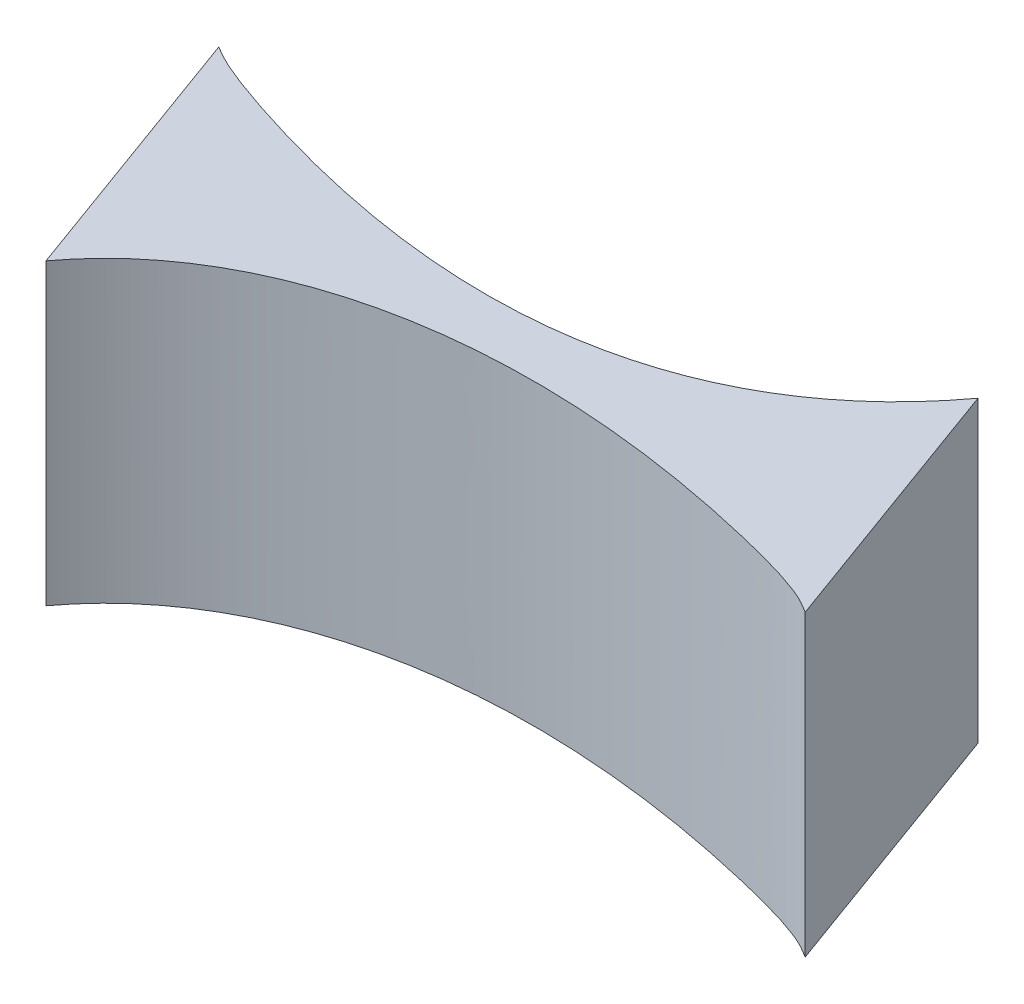
ISO-10303-21;
HEADER;
FILE_DESCRIPTION(('STEP AP214'),'2;1');
FILE_NAME('part.step','',(''),(''),'','','');
FILE_SCHEMA(('AUTOMOTIVE_DESIGN { 1 0 10303 214 1 1 1 1 }'));
ENDSEC;
DATA;
#1=APPLICATION_CONTEXT('core data for automotive mechanical design processes');
#2=APPLICATION_PROTOCOL_DEFINITION('international standard','automotive_design',2000,#1);
#3=PRODUCT_CONTEXT('',#1,'mechanical');
#4=PRODUCT('Part','Part','',(#3));
#5=PRODUCT_RELATED_PRODUCT_CATEGORY('part','',(#4));
#6=PRODUCT_DEFINITION_FORMATION('','',#4);
#7=PRODUCT_DEFINITION_CONTEXT('part definition',#1,'design');
#8=PRODUCT_DEFINITION('design','',#6,#7);
#9=PRODUCT_DEFINITION_SHAPE('','',#8);
#10=(LENGTH_UNIT() NAMED_UNIT(*) SI_UNIT(.MILLI.,.METRE.));
#11=(NAMED_UNIT(*) PLANE_ANGLE_UNIT() SI_UNIT($,.RADIAN.));
#12=(NAMED_UNIT(*) SI_UNIT($,.STERADIAN.) SOLID_ANGLE_UNIT());
#13=UNCERTAINTY_MEASURE_WITH_UNIT(LENGTH_MEASURE(1.E-05),#10,'distance_accuracy_value','');
#14=(GEOMETRIC_REPRESENTATION_CONTEXT(3) GLOBAL_UNCERTAINTY_ASSIGNED_CONTEXT((#13)) GLOBAL_UNIT_ASSIGNED_CONTEXT((#10,
#11,#12)) REPRESENTATION_CONTEXT('',''));
#15=CARTESIAN_POINT('',(0.,0.,0.));
#16=DIRECTION('',(0.,0.,1.));
#17=DIRECTION('',(1.,0.,0.));
#18=AXIS2_PLACEMENT_3D('',#15,#16,#17);
#19=CARTESIAN_POINT('',(55.99141165,31.,16.37494241));
#20=CARTESIAN_POINT('',(45.9589071426277,31.,30.0088587918136));
#21=CARTESIAN_POINT('',(25.1940801985104,31.,38.9228976862621));
#22=CARTESIAN_POINT('',(-12.7605911762868,31.,25.6027656969055));
#23=CARTESIAN_POINT('',(-14.60542194485,31.,24.4118187466659));
#24=CARTESIAN_POINT('',(-14.97688437,31.,24.20026596));
#25=B_SPLINE_CURVE_WITH_KNOTS('',3,(#19,#20,#21,#22,#23,#24),.UNSPECIFIED.,.F.,.F.,(4,1,1,4),
(0.,0.403451926214958,0.449136908996291,0.45684982781333),.UNSPECIFIED.);
#26=DIRECTION('',(0.,-1.,0.));
#27=VECTOR('',#26,1.);
#28=SURFACE_OF_LINEAR_EXTRUSION('',#25,#27);
#29=CARTESIAN_POINT('',(55.99141165,0.,16.37494241));
#30=CARTESIAN_POINT('',(45.9589071426277,0.,30.0088587918136));
#31=CARTESIAN_POINT('',(25.1940801985104,0.,38.9228976862621));
#32=CARTESIAN_POINT('',(-12.7605911762868,0.,25.6027656969055));
#33=CARTESIAN_POINT('',(-14.60542194485,0.,24.4118187466659));
#34=CARTESIAN_POINT('',(-14.97688437,0.,24.20026596));
#35=B_SPLINE_CURVE_WITH_KNOTS('',3,(#29,#30,#31,#32,#33,#34),.UNSPECIFIED.,.F.,.F.,(4,1,1,4),
(0.,0.403451926214958,0.449136908996291,0.45684982781333),.UNSPECIFIED.);
#36=CARTESIAN_POINT('',(55.99141165,0.,16.37494241));
#37=VERTEX_POINT('',#36);
#38=CARTESIAN_POINT('',(-14.97688437,0.,24.20026596));
#39=VERTEX_POINT('',#38);
#40=EDGE_CURVE('E118',#37,#39,#35,.T.);
#41=ORIENTED_EDGE('',*,*,#40,.T.);
#42=DIRECTION('',(0.,-1.,0.));
#43=VECTOR('',#42,1.);
#44=CARTESIAN_POINT('',(-14.97688437,31.,24.20026596));
#45=LINE('',#44,#43);
#46=CARTESIAN_POINT('',(-14.97688437,31.,24.20026596));
#47=VERTEX_POINT('',#46);
#48=EDGE_CURVE('E11',#47,#39,#45,.T.);
#49=ORIENTED_EDGE('',*,*,#48,.F.);
#50=CARTESIAN_POINT('',(55.99141165,31.,16.37494241));
#51=VERTEX_POINT('',#50);
#52=EDGE_CURVE('E87',#51,#47,#25,.T.);
#53=ORIENTED_EDGE('',*,*,#52,.F.);
#54=DIRECTION('',(0.,-1.,0.));
#55=VECTOR('',#54,1.);
#56=CARTESIAN_POINT('',(55.99141165,31.,16.37494241));
#57=LINE('',#56,#55);
#58=EDGE_CURVE('E95',#51,#37,#57,.T.);
#59=ORIENTED_EDGE('',*,*,#58,.T.);
#60=EDGE_LOOP('',(#41,#49,#53,#59));
#61=FACE_BOUND('',#60,.T.);
#62=ADVANCED_FACE('F35',(#61),#28,.F.);
#63=CARTESIAN_POINT('',(-4.71628007171826,31.,52.3910445879398));
#64=DIRECTION('',(0.939692620818864,0.,-0.342020143235124));
#65=DIRECTION('',(-0.342020143235124,0.,-0.939692620818864));
#66=AXIS2_PLACEMENT_3D('',#63,#64,#65);
#67=PLANE('',#66);
#68=DIRECTION('',(0.342020143235124,0.,0.939692620818864));
#69=VECTOR('',#68,1.);
#70=CARTESIAN_POINT('',(-4.71628007171826,0.,52.3910445879398));
#71=LINE('',#70,#69);
#72=CARTESIAN_POINT('',(-4.71628007171826,0.,52.3910445879398));
#73=VERTEX_POINT('',#72);
#74=EDGE_CURVE('E91',#39,#73,#71,.T.);
#75=ORIENTED_EDGE('',*,*,#74,.T.);
#76=DIRECTION('',(0.,-1.,0.));
#77=VECTOR('',#76,1.);
#78=CARTESIAN_POINT('',(-4.71628007171826,31.,52.3910445879398));
#79=LINE('',#78,#77);
#80=CARTESIAN_POINT('',(-4.71628007171826,31.,52.3910445879398));
#81=VERTEX_POINT('',#80);
#82=EDGE_CURVE('E44',#81,#73,#79,.T.);
#83=ORIENTED_EDGE('',*,*,#82,.F.);
#84=DIRECTION('',(0.342020143235124,0.,0.939692620818864));
#85=VECTOR('',#84,1.);
#86=CARTESIAN_POINT('',(-4.71628007171826,31.,52.3910445879398));
#87=LINE('',#86,#85);
#88=EDGE_CURVE('E82',#47,#81,#87,.T.);
#89=ORIENTED_EDGE('',*,*,#88,.F.);
#90=ORIENTED_EDGE('',*,*,#48,.T.);
#91=EDGE_LOOP('',(#75,#83,#89,#90));
#92=FACE_BOUND('',#91,.T.);
#93=ADVANCED_FACE('F90',(#92),#67,.F.);
#94=CARTESIAN_POINT('',(-4.71628007171826,31.,52.3910445879398));
#95=CARTESIAN_POINT('',(5.3162244356541,31.,38.7571282061263));
#96=CARTESIAN_POINT('',(29.9417952639014,31.,33.5547163497801));
#97=CARTESIAN_POINT('',(63.9367439137895,31.,43.0680654030608));
#98=CARTESIAN_POINT('',(65.8805535250994,31.,44.3541682507653));
#99=CARTESIAN_POINT('',(66.2520159502494,31.,44.5657210374312));
#100=B_SPLINE_CURVE_WITH_KNOTS('',3,(#94,#95,#96,#97,#98,#99),.UNSPECIFIED.,.F.,.F.,(4,1,1,4),
(0.,0.403451926214958,0.449136908996291,0.45684982781333),.UNSPECIFIED.);
#101=DIRECTION('',(0.,-1.,0.));
#102=VECTOR('',#101,1.);
#103=SURFACE_OF_LINEAR_EXTRUSION('',#100,#102);
#104=CARTESIAN_POINT('',(-4.71628007171826,0.,52.3910445879398));
#105=CARTESIAN_POINT('',(5.3162244356541,0.,38.7571282061263));
#106=CARTESIAN_POINT('',(29.9417952639014,0.,33.5547163497801));
#107=CARTESIAN_POINT('',(63.9367439137895,0.,43.0680654030608));
#108=CARTESIAN_POINT('',(65.8805535250994,0.,44.3541682507653));
#109=CARTESIAN_POINT('',(66.2520159502494,0.,44.5657210374312));
#110=B_SPLINE_CURVE_WITH_KNOTS('',3,(#104,#105,#106,#107,#108,#109),.UNSPECIFIED.,.F.,.F.,(4,1,
1,4),(0.,0.403451926214958,0.449136908996291,0.45684982781333),.UNSPECIFIED.);
#111=CARTESIAN_POINT('',(66.2520159502494,0.,44.5657210374312));
#112=VERTEX_POINT('',#111);
#113=EDGE_CURVE('E69',#73,#112,#110,.T.);
#114=ORIENTED_EDGE('',*,*,#113,.T.);
#115=DIRECTION('',(0.,-1.,0.));
#116=VECTOR('',#115,1.);
#117=CARTESIAN_POINT('',(66.2520159502494,31.,44.5657210374312));
#118=LINE('',#117,#116);
#119=CARTESIAN_POINT('',(66.2520159502494,31.,44.5657210374312));
#120=VERTEX_POINT('',#119);
#121=EDGE_CURVE('E92',#120,#112,#118,.T.);
#122=ORIENTED_EDGE('',*,*,#121,.F.);
#123=EDGE_CURVE('E85',#81,#120,#100,.T.);
#124=ORIENTED_EDGE('',*,*,#123,.F.);
#125=ORIENTED_EDGE('',*,*,#82,.T.);
#126=EDGE_LOOP('',(#114,#122,#124,#125));
#127=FACE_BOUND('',#126,.T.);
#128=ADVANCED_FACE('F93',(#127),#103,.F.);
#129=CARTESIAN_POINT('',(66.2520159502494,31.,44.5657210374312));
#130=DIRECTION('',(-0.939692620795801,0.,0.34202014329849));
#131=DIRECTION('',(0.34202014329849,0.,0.939692620795801));
#132=AXIS2_PLACEMENT_3D('',#129,#130,#131);
#133=PLANE('',#132);
#134=DIRECTION('',(-0.34202014329849,0.,-0.939692620795801));
#135=VECTOR('',#134,1.);
#136=CARTESIAN_POINT('',(66.2520159502494,0.,44.5657210374312));
#137=LINE('',#136,#135);
#138=EDGE_CURVE('E75',#112,#37,#137,.T.);
#139=ORIENTED_EDGE('',*,*,#138,.T.);
#140=ORIENTED_EDGE('',*,*,#58,.F.);
#141=DIRECTION('',(-0.34202014329849,0.,-0.939692620795801));
#142=VECTOR('',#141,1.);
#143=CARTESIAN_POINT('',(66.2520159502494,31.,44.5657210374312));
#144=LINE('',#143,#142);
#145=EDGE_CURVE('E52',#120,#51,#144,.T.);
#146=ORIENTED_EDGE('',*,*,#145,.F.);
#147=ORIENTED_EDGE('',*,*,#121,.T.);
#148=EDGE_LOOP('',(#139,#140,#146,#147));
#149=FACE_BOUND('',#148,.T.);
#150=ADVANCED_FACE('F107',(#149),#133,.F.);
#151=CARTESIAN_POINT('',(29.8020926701135,31.,31.919614999439));
#152=DIRECTION('',(0.,1.,0.));
#153=DIRECTION('',(0.,0.,1.));
#154=AXIS2_PLACEMENT_3D('',#151,#152,#153);
#155=PLANE('',#154);
#156=ORIENTED_EDGE('',*,*,#52,.T.);
#157=ORIENTED_EDGE('',*,*,#88,.T.);
#158=ORIENTED_EDGE('',*,*,#123,.T.);
#159=ORIENTED_EDGE('',*,*,#145,.T.);
#160=EDGE_LOOP('',(#156,#157,#158,#159));
#161=FACE_BOUND('',#160,.T.);
#162=ADVANCED_FACE('F83',(#161),#155,.T.);
#163=CARTESIAN_POINT('',(29.8020926701135,0.,31.919614999439));
#164=DIRECTION('',(0.,1.,0.));
#165=DIRECTION('',(0.,0.,1.));
#166=AXIS2_PLACEMENT_3D('',#163,#164,#165);
#167=PLANE('',#166);
#168=ORIENTED_EDGE('',*,*,#40,.F.);
#169=ORIENTED_EDGE('',*,*,#138,.F.);
#170=ORIENTED_EDGE('',*,*,#113,.F.);
#171=ORIENTED_EDGE('',*,*,#74,.F.);
#172=EDGE_LOOP('',(#168,#169,#170,#171));
#173=FACE_BOUND('',#172,.T.);
#174=ADVANCED_FACE('F135',(#173),#167,.F.);
#175=CLOSED_SHELL('',(#62,#93,#128,#150,#162,#174));
#176=MANIFOLD_SOLID_BREP('B2',#175);
#177=ADVANCED_BREP_SHAPE_REPRESENTATION('',(#18,#176),#14);
#178=SHAPE_DEFINITION_REPRESENTATION(#9,#177);
ENDSEC;
END-ISO-10303-21;
